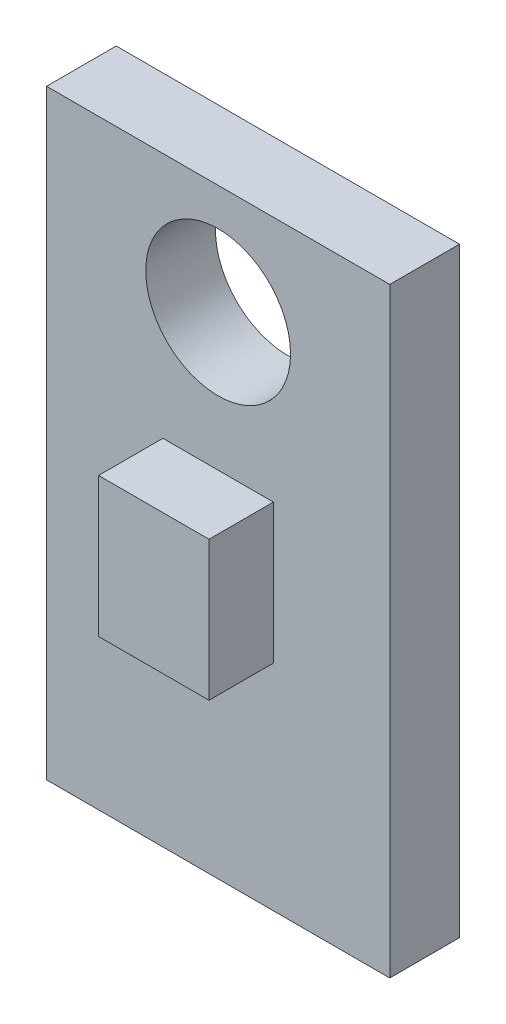
ISO-10303-21;
HEADER;
FILE_DESCRIPTION(('STEP AP214'),'2;1');
FILE_NAME('part.step','',(''),(''),'','','');
FILE_SCHEMA(('AUTOMOTIVE_DESIGN { 1 0 10303 214 1 1 1 1 }'));
ENDSEC;
DATA;
#1=APPLICATION_CONTEXT('core data for automotive mechanical design processes');
#2=APPLICATION_PROTOCOL_DEFINITION('international standard','automotive_design',2000,#1);
#3=PRODUCT_CONTEXT('',#1,'mechanical');
#4=PRODUCT('Part','Part','',(#3));
#5=PRODUCT_RELATED_PRODUCT_CATEGORY('part','',(#4));
#6=PRODUCT_DEFINITION_FORMATION('','',#4);
#7=PRODUCT_DEFINITION_CONTEXT('part definition',#1,'design');
#8=PRODUCT_DEFINITION('design','',#6,#7);
#9=PRODUCT_DEFINITION_SHAPE('','',#8);
#10=(LENGTH_UNIT() NAMED_UNIT(*) SI_UNIT(.MILLI.,.METRE.));
#11=(NAMED_UNIT(*) PLANE_ANGLE_UNIT() SI_UNIT($,.RADIAN.));
#12=(NAMED_UNIT(*) SI_UNIT($,.STERADIAN.) SOLID_ANGLE_UNIT());
#13=UNCERTAINTY_MEASURE_WITH_UNIT(LENGTH_MEASURE(1.E-05),#10,'distance_accuracy_value','');
#14=(GEOMETRIC_REPRESENTATION_CONTEXT(3) GLOBAL_UNCERTAINTY_ASSIGNED_CONTEXT((#13)) GLOBAL_UNIT_ASSIGNED_CONTEXT((#10,
#11,#12)) REPRESENTATION_CONTEXT('',''));
#15=CARTESIAN_POINT('',(0.,0.,0.));
#16=DIRECTION('',(0.,0.,1.));
#17=DIRECTION('',(1.,0.,0.));
#18=AXIS2_PLACEMENT_3D('',#15,#16,#17);
#19=CARTESIAN_POINT('',(0.,0.,1.651));
#20=DIRECTION('',(0.,0.,-1.));
#21=DIRECTION('',(-1.,0.,0.));
#22=AXIS2_PLACEMENT_3D('',#19,#20,#21);
#23=PLANE('',#22);
#24=CARTESIAN_POINT('',(4.064,11.6205,1.651));
#25=DIRECTION('',(0.,0.,1.));
#26=DIRECTION('',(1.,0.,0.));
#27=AXIS2_PLACEMENT_3D('',#24,#25,#26);
#28=CIRCLE('',#27,1.7145);
#29=CARTESIAN_POINT('',(5.7785,11.6205,1.651));
#30=VERTEX_POINT('',#29);
#31=EDGE_CURVE('E289',#30,#30,#28,.T.);
#32=ORIENTED_EDGE('',*,*,#31,.F.);
#33=EDGE_LOOP('',(#32));
#34=FACE_BOUND('',#33,.T.);
#35=DIRECTION('',(0.,-1.,0.));
#36=VECTOR('',#35,1.);
#37=CARTESIAN_POINT('',(0.,0.,1.651));
#38=LINE('',#37,#36);
#39=CARTESIAN_POINT('',(0.,14.224,1.651));
#40=VERTEX_POINT('',#39);
#41=CARTESIAN_POINT('',(0.,0.,1.651));
#42=VERTEX_POINT('',#41);
#43=EDGE_CURVE('E141',#40,#42,#38,.T.);
#44=ORIENTED_EDGE('',*,*,#43,.T.);
#45=DIRECTION('',(1.,0.,0.));
#46=VECTOR('',#45,1.);
#47=CARTESIAN_POINT('',(0.,0.,1.651));
#48=LINE('',#47,#46);
#49=CARTESIAN_POINT('',(8.128,0.,1.651));
#50=VERTEX_POINT('',#49);
#51=EDGE_CURVE('E144',#42,#50,#48,.T.);
#52=ORIENTED_EDGE('',*,*,#51,.T.);
#53=DIRECTION('',(0.,1.,0.));
#54=VECTOR('',#53,1.);
#55=CARTESIAN_POINT('',(8.128,0.,1.651));
#56=LINE('',#55,#54);
#57=CARTESIAN_POINT('',(8.128,14.224,1.651));
#58=VERTEX_POINT('',#57);
#59=EDGE_CURVE('E147',#50,#58,#56,.T.);
#60=ORIENTED_EDGE('',*,*,#59,.T.);
#61=DIRECTION('',(-1.,0.,0.));
#62=VECTOR('',#61,1.);
#63=CARTESIAN_POINT('',(0.,14.224,1.651));
#64=LINE('',#63,#62);
#65=EDGE_CURVE('E149',#58,#40,#64,.T.);
#66=ORIENTED_EDGE('',*,*,#65,.T.);
#67=EDGE_LOOP('',(#44,#52,#60,#66));
#68=FACE_BOUND('',#67,.T.);
#69=DIRECTION('',(0.,1.,0.));
#70=VECTOR('',#69,1.);
#71=CARTESIAN_POINT('',(5.3721,5.08,1.651));
#72=LINE('',#71,#70);
#73=CARTESIAN_POINT('',(5.3721,5.08,1.651));
#74=VERTEX_POINT('',#73);
#75=CARTESIAN_POINT('',(5.3721,8.382,1.651));
#76=VERTEX_POINT('',#75);
#77=EDGE_CURVE('E131',#74,#76,#72,.T.);
#78=ORIENTED_EDGE('',*,*,#77,.F.);
#79=DIRECTION('',(1.,0.,0.));
#80=VECTOR('',#79,1.);
#81=CARTESIAN_POINT('',(5.3721,5.08,1.651));
#82=LINE('',#81,#80);
#83=CARTESIAN_POINT('',(2.7559,5.08,1.651));
#84=VERTEX_POINT('',#83);
#85=EDGE_CURVE('E128',#84,#74,#82,.T.);
#86=ORIENTED_EDGE('',*,*,#85,.F.);
#87=DIRECTION('',(0.,-1.,0.));
#88=VECTOR('',#87,1.);
#89=CARTESIAN_POINT('',(2.7559,5.08,1.651));
#90=LINE('',#89,#88);
#91=CARTESIAN_POINT('',(2.7559,8.382,1.651));
#92=VERTEX_POINT('',#91);
#93=EDGE_CURVE('E66',#92,#84,#90,.T.);
#94=ORIENTED_EDGE('',*,*,#93,.F.);
#95=DIRECTION('',(-1.,0.,0.));
#96=VECTOR('',#95,1.);
#97=CARTESIAN_POINT('',(5.3721,8.382,1.651));
#98=LINE('',#97,#96);
#99=EDGE_CURVE('E61',#76,#92,#98,.T.);
#100=ORIENTED_EDGE('',*,*,#99,.F.);
#101=EDGE_LOOP('',(#78,#86,#94,#100));
#102=FACE_BOUND('',#101,.T.);
#103=ADVANCED_FACE('F46',(#34,#68,#102),#23,.F.);
#104=CARTESIAN_POINT('',(0.,0.,1.651));
#105=DIRECTION('',(1.,0.,0.));
#106=DIRECTION('',(0.,0.,-1.));
#107=AXIS2_PLACEMENT_3D('',#104,#105,#106);
#108=PLANE('',#107);
#109=DIRECTION('',(0.,-1.,0.));
#110=VECTOR('',#109,1.);
#111=CARTESIAN_POINT('',(0.,0.,0.));
#112=LINE('',#111,#110);
#113=CARTESIAN_POINT('',(0.,14.224,0.));
#114=VERTEX_POINT('',#113);
#115=CARTESIAN_POINT('',(0.,0.,0.));
#116=VERTEX_POINT('',#115);
#117=EDGE_CURVE('E132',#114,#116,#112,.T.);
#118=ORIENTED_EDGE('',*,*,#117,.T.);
#119=DIRECTION('',(0.,0.,-1.));
#120=VECTOR('',#119,1.);
#121=CARTESIAN_POINT('',(0.,0.,1.651));
#122=LINE('',#121,#120);
#123=EDGE_CURVE('E13',#42,#116,#122,.T.);
#124=ORIENTED_EDGE('',*,*,#123,.F.);
#125=ORIENTED_EDGE('',*,*,#43,.F.);
#126=DIRECTION('',(0.,0.,-1.));
#127=VECTOR('',#126,1.);
#128=CARTESIAN_POINT('',(0.,14.224,1.651));
#129=LINE('',#128,#127);
#130=EDGE_CURVE('E150',#40,#114,#129,.T.);
#131=ORIENTED_EDGE('',*,*,#130,.T.);
#132=EDGE_LOOP('',(#118,#124,#125,#131));
#133=FACE_BOUND('',#132,.T.);
#134=ADVANCED_FACE('F48',(#133),#108,.F.);
#135=CARTESIAN_POINT('',(0.,0.,1.651));
#136=DIRECTION('',(0.,1.,0.));
#137=DIRECTION('',(0.,0.,1.));
#138=AXIS2_PLACEMENT_3D('',#135,#136,#137);
#139=PLANE('',#138);
#140=DIRECTION('',(1.,0.,0.));
#141=VECTOR('',#140,1.);
#142=CARTESIAN_POINT('',(0.,0.,0.));
#143=LINE('',#142,#141);
#144=CARTESIAN_POINT('',(8.128,0.,0.));
#145=VERTEX_POINT('',#144);
#146=EDGE_CURVE('E135',#116,#145,#143,.T.);
#147=ORIENTED_EDGE('',*,*,#146,.T.);
#148=DIRECTION('',(0.,0.,-1.));
#149=VECTOR('',#148,1.);
#150=CARTESIAN_POINT('',(8.128,0.,1.651));
#151=LINE('',#150,#149);
#152=EDGE_CURVE('E54',#50,#145,#151,.T.);
#153=ORIENTED_EDGE('',*,*,#152,.F.);
#154=ORIENTED_EDGE('',*,*,#51,.F.);
#155=ORIENTED_EDGE('',*,*,#123,.T.);
#156=EDGE_LOOP('',(#147,#153,#154,#155));
#157=FACE_BOUND('',#156,.T.);
#158=ADVANCED_FACE('F180',(#157),#139,.F.);
#159=CARTESIAN_POINT('',(8.128,0.,1.651));
#160=DIRECTION('',(-1.,0.,0.));
#161=DIRECTION('',(0.,0.,1.));
#162=AXIS2_PLACEMENT_3D('',#159,#160,#161);
#163=PLANE('',#162);
#164=DIRECTION('',(0.,1.,0.));
#165=VECTOR('',#164,1.);
#166=CARTESIAN_POINT('',(8.128,0.,0.));
#167=LINE('',#166,#165);
#168=CARTESIAN_POINT('',(8.128,14.224,0.));
#169=VERTEX_POINT('',#168);
#170=EDGE_CURVE('E153',#145,#169,#167,.T.);
#171=ORIENTED_EDGE('',*,*,#170,.T.);
#172=DIRECTION('',(0.,0.,-1.));
#173=VECTOR('',#172,1.);
#174=CARTESIAN_POINT('',(8.128,14.224,1.651));
#175=LINE('',#174,#173);
#176=EDGE_CURVE('E158',#58,#169,#175,.T.);
#177=ORIENTED_EDGE('',*,*,#176,.F.);
#178=ORIENTED_EDGE('',*,*,#59,.F.);
#179=ORIENTED_EDGE('',*,*,#152,.T.);
#180=EDGE_LOOP('',(#171,#177,#178,#179));
#181=FACE_BOUND('',#180,.T.);
#182=ADVANCED_FACE('F165',(#181),#163,.F.);
#183=CARTESIAN_POINT('',(0.,14.224,1.651));
#184=DIRECTION('',(0.,-1.,0.));
#185=DIRECTION('',(0.,0.,-1.));
#186=AXIS2_PLACEMENT_3D('',#183,#184,#185);
#187=PLANE('',#186);
#188=DIRECTION('',(-1.,0.,0.));
#189=VECTOR('',#188,1.);
#190=CARTESIAN_POINT('',(0.,14.224,0.));
#191=LINE('',#190,#189);
#192=EDGE_CURVE('E145',#169,#114,#191,.T.);
#193=ORIENTED_EDGE('',*,*,#192,.T.);
#194=ORIENTED_EDGE('',*,*,#130,.F.);
#195=ORIENTED_EDGE('',*,*,#65,.F.);
#196=ORIENTED_EDGE('',*,*,#176,.T.);
#197=EDGE_LOOP('',(#193,#194,#195,#196));
#198=FACE_BOUND('',#197,.T.);
#199=ADVANCED_FACE('F174',(#198),#187,.F.);
#200=CARTESIAN_POINT('',(0.,0.,0.));
#201=DIRECTION('',(0.,0.,-1.));
#202=DIRECTION('',(-1.,0.,0.));
#203=AXIS2_PLACEMENT_3D('',#200,#201,#202);
#204=PLANE('',#203);
#205=CARTESIAN_POINT('',(4.064,11.6205,0.));
#206=DIRECTION('',(0.,0.,1.));
#207=DIRECTION('',(1.,0.,0.));
#208=AXIS2_PLACEMENT_3D('',#205,#206,#207);
#209=CIRCLE('',#208,1.7145);
#210=CARTESIAN_POINT('',(5.7785,11.6205,0.));
#211=VERTEX_POINT('',#210);
#212=EDGE_CURVE('E287',#211,#211,#209,.T.);
#213=ORIENTED_EDGE('',*,*,#212,.T.);
#214=EDGE_LOOP('',(#213));
#215=FACE_BOUND('',#214,.T.);
#216=ORIENTED_EDGE('',*,*,#117,.F.);
#217=ORIENTED_EDGE('',*,*,#192,.F.);
#218=ORIENTED_EDGE('',*,*,#170,.F.);
#219=ORIENTED_EDGE('',*,*,#146,.F.);
#220=EDGE_LOOP('',(#216,#217,#218,#219));
#221=FACE_BOUND('',#220,.T.);
#222=ADVANCED_FACE('F171',(#215,#221),#204,.T.);
#223=CARTESIAN_POINT('',(5.3721,5.08,3.175));
#224=DIRECTION('',(-1.,0.,0.));
#225=DIRECTION('',(0.,0.,1.));
#226=AXIS2_PLACEMENT_3D('',#223,#224,#225);
#227=PLANE('',#226);
#228=ORIENTED_EDGE('',*,*,#77,.T.);
#229=DIRECTION('',(0.,0.,-1.));
#230=VECTOR('',#229,1.);
#231=CARTESIAN_POINT('',(5.3721,8.382,3.175));
#232=LINE('',#231,#230);
#233=CARTESIAN_POINT('',(5.3721,8.382,3.175));
#234=VERTEX_POINT('',#233);
#235=EDGE_CURVE('E112',#234,#76,#232,.T.);
#236=ORIENTED_EDGE('',*,*,#235,.F.);
#237=DIRECTION('',(0.,1.,0.));
#238=VECTOR('',#237,1.);
#239=CARTESIAN_POINT('',(5.3721,5.08,3.175));
#240=LINE('',#239,#238);
#241=CARTESIAN_POINT('',(5.3721,5.08,3.175));
#242=VERTEX_POINT('',#241);
#243=EDGE_CURVE('E119',#242,#234,#240,.T.);
#244=ORIENTED_EDGE('',*,*,#243,.F.);
#245=DIRECTION('',(0.,0.,-1.));
#246=VECTOR('',#245,1.);
#247=CARTESIAN_POINT('',(5.3721,5.08,3.175));
#248=LINE('',#247,#246);
#249=EDGE_CURVE('E295',#242,#74,#248,.T.);
#250=ORIENTED_EDGE('',*,*,#249,.T.);
#251=EDGE_LOOP('',(#228,#236,#244,#250));
#252=FACE_BOUND('',#251,.T.);
#253=ADVANCED_FACE('F130',(#252),#227,.F.);
#254=CARTESIAN_POINT('',(5.3721,8.382,3.175));
#255=DIRECTION('',(0.,-1.,0.));
#256=DIRECTION('',(0.,0.,-1.));
#257=AXIS2_PLACEMENT_3D('',#254,#255,#256);
#258=PLANE('',#257);
#259=ORIENTED_EDGE('',*,*,#99,.T.);
#260=DIRECTION('',(0.,0.,-1.));
#261=VECTOR('',#260,1.);
#262=CARTESIAN_POINT('',(2.7559,8.382,3.175));
#263=LINE('',#262,#261);
#264=CARTESIAN_POINT('',(2.7559,8.382,3.175));
#265=VERTEX_POINT('',#264);
#266=EDGE_CURVE('E115',#265,#92,#263,.T.);
#267=ORIENTED_EDGE('',*,*,#266,.F.);
#268=DIRECTION('',(-1.,0.,0.));
#269=VECTOR('',#268,1.);
#270=CARTESIAN_POINT('',(5.3721,8.382,3.175));
#271=LINE('',#270,#269);
#272=EDGE_CURVE('E108',#234,#265,#271,.T.);
#273=ORIENTED_EDGE('',*,*,#272,.F.);
#274=ORIENTED_EDGE('',*,*,#235,.T.);
#275=EDGE_LOOP('',(#259,#267,#273,#274));
#276=FACE_BOUND('',#275,.T.);
#277=ADVANCED_FACE('F110',(#276),#258,.F.);
#278=CARTESIAN_POINT('',(2.7559,5.08,3.175));
#279=DIRECTION('',(1.,0.,0.));
#280=DIRECTION('',(0.,0.,-1.));
#281=AXIS2_PLACEMENT_3D('',#278,#279,#280);
#282=PLANE('',#281);
#283=ORIENTED_EDGE('',*,*,#93,.T.);
#284=DIRECTION('',(0.,0.,-1.));
#285=VECTOR('',#284,1.);
#286=CARTESIAN_POINT('',(2.7559,5.08,3.175));
#287=LINE('',#286,#285);
#288=CARTESIAN_POINT('',(2.7559,5.08,3.175));
#289=VERTEX_POINT('',#288);
#290=EDGE_CURVE('E137',#289,#84,#287,.T.);
#291=ORIENTED_EDGE('',*,*,#290,.F.);
#292=DIRECTION('',(0.,-1.,0.));
#293=VECTOR('',#292,1.);
#294=CARTESIAN_POINT('',(2.7559,5.08,3.175));
#295=LINE('',#294,#293);
#296=EDGE_CURVE('E118',#265,#289,#295,.T.);
#297=ORIENTED_EDGE('',*,*,#296,.F.);
#298=ORIENTED_EDGE('',*,*,#266,.T.);
#299=EDGE_LOOP('',(#283,#291,#297,#298));
#300=FACE_BOUND('',#299,.T.);
#301=ADVANCED_FACE('F224',(#300),#282,.F.);
#302=CARTESIAN_POINT('',(5.3721,5.08,3.175));
#303=DIRECTION('',(0.,1.,0.));
#304=DIRECTION('',(0.,0.,1.));
#305=AXIS2_PLACEMENT_3D('',#302,#303,#304);
#306=PLANE('',#305);
#307=ORIENTED_EDGE('',*,*,#85,.T.);
#308=ORIENTED_EDGE('',*,*,#249,.F.);
#309=DIRECTION('',(1.,0.,0.));
#310=VECTOR('',#309,1.);
#311=CARTESIAN_POINT('',(5.3721,5.08,3.175));
#312=LINE('',#311,#310);
#313=EDGE_CURVE('E124',#289,#242,#312,.T.);
#314=ORIENTED_EDGE('',*,*,#313,.F.);
#315=ORIENTED_EDGE('',*,*,#290,.T.);
#316=EDGE_LOOP('',(#307,#308,#314,#315));
#317=FACE_BOUND('',#316,.T.);
#318=ADVANCED_FACE('F230',(#317),#306,.F.);
#319=CARTESIAN_POINT('',(0.,0.,3.175));
#320=DIRECTION('',(0.,0.,1.));
#321=DIRECTION('',(1.,0.,0.));
#322=AXIS2_PLACEMENT_3D('',#319,#320,#321);
#323=PLANE('',#322);
#324=ORIENTED_EDGE('',*,*,#243,.T.);
#325=ORIENTED_EDGE('',*,*,#272,.T.);
#326=ORIENTED_EDGE('',*,*,#296,.T.);
#327=ORIENTED_EDGE('',*,*,#313,.T.);
#328=EDGE_LOOP('',(#324,#325,#326,#327));
#329=FACE_BOUND('',#328,.T.);
#330=ADVANCED_FACE('F122',(#329),#323,.T.);
#331=CARTESIAN_POINT('',(4.064,11.6205,0.));
#332=DIRECTION('',(0.,0.,1.));
#333=DIRECTION('',(1.,0.,0.));
#334=AXIS2_PLACEMENT_3D('',#331,#332,#333);
#335=CYLINDRICAL_SURFACE('',#334,1.7145);
#336=ORIENTED_EDGE('',*,*,#212,.F.);
#337=EDGE_LOOP('',(#336));
#338=FACE_BOUND('',#337,.T.);
#339=ORIENTED_EDGE('',*,*,#31,.T.);
#340=EDGE_LOOP('',(#339));
#341=FACE_BOUND('',#340,.T.);
#342=ADVANCED_FACE('F244',(#338,#341),#335,.F.);
#343=CLOSED_SHELL('',(#103,#134,#158,#182,#199,#222,#253,#277,#301,#318,#330,#342));
#344=MANIFOLD_SOLID_BREP('B2',#343);
#345=ADVANCED_BREP_SHAPE_REPRESENTATION('',(#18,#344),#14);
#346=SHAPE_DEFINITION_REPRESENTATION(#9,#345);
ENDSEC;
END-ISO-10303-21;
